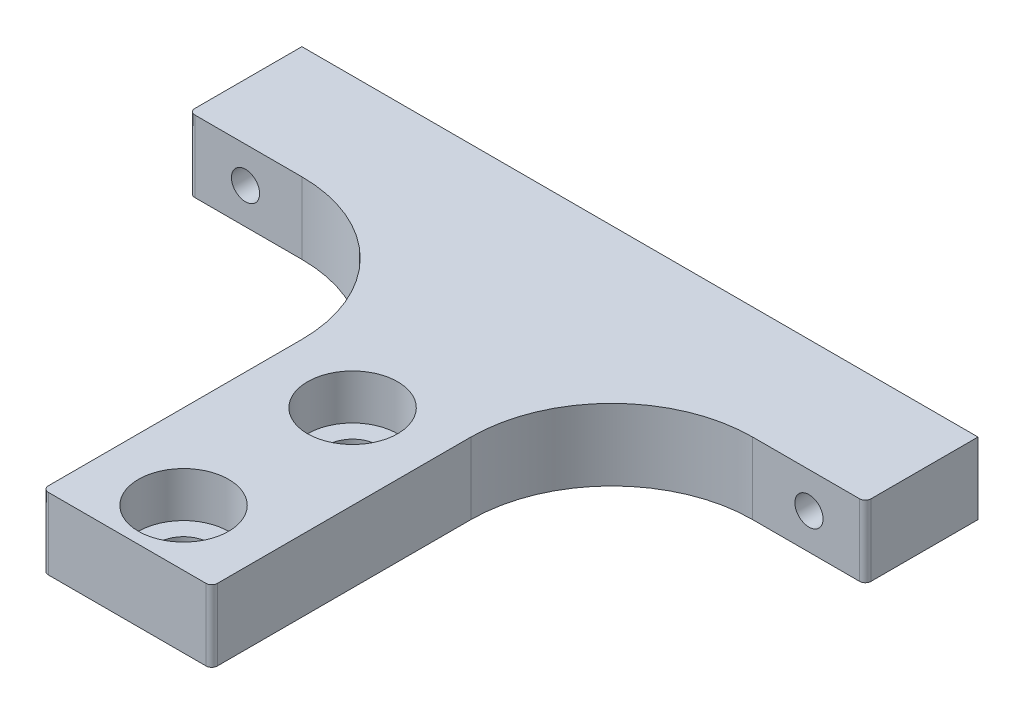
ISO-10303-21;
HEADER;
FILE_DESCRIPTION(('STEP AP214'),'2;1');
FILE_NAME('part.step','',(''),(''),'','','');
FILE_SCHEMA(('AUTOMOTIVE_DESIGN { 1 0 10303 214 1 1 1 1 }'));
ENDSEC;
DATA;
#1=APPLICATION_CONTEXT('core data for automotive mechanical design processes');
#2=APPLICATION_PROTOCOL_DEFINITION('international standard','automotive_design',2000,#1);
#3=PRODUCT_CONTEXT('',#1,'mechanical');
#4=PRODUCT('Part','Part','',(#3));
#5=PRODUCT_RELATED_PRODUCT_CATEGORY('part','',(#4));
#6=PRODUCT_DEFINITION_FORMATION('','',#4);
#7=PRODUCT_DEFINITION_CONTEXT('part definition',#1,'design');
#8=PRODUCT_DEFINITION('design','',#6,#7);
#9=PRODUCT_DEFINITION_SHAPE('','',#8);
#10=(LENGTH_UNIT() NAMED_UNIT(*) SI_UNIT(.MILLI.,.METRE.));
#11=(NAMED_UNIT(*) PLANE_ANGLE_UNIT() SI_UNIT($,.RADIAN.));
#12=(NAMED_UNIT(*) SI_UNIT($,.STERADIAN.) SOLID_ANGLE_UNIT());
#13=UNCERTAINTY_MEASURE_WITH_UNIT(LENGTH_MEASURE(1.E-05),#10,'distance_accuracy_value','');
#14=(GEOMETRIC_REPRESENTATION_CONTEXT(3) GLOBAL_UNCERTAINTY_ASSIGNED_CONTEXT((#13)) GLOBAL_UNIT_ASSIGNED_CONTEXT((#10,
#11,#12)) REPRESENTATION_CONTEXT('',''));
#15=CARTESIAN_POINT('',(0.,0.,0.));
#16=DIRECTION('',(0.,0.,1.));
#17=DIRECTION('',(1.,0.,0.));
#18=AXIS2_PLACEMENT_3D('',#15,#16,#17);
#19=CARTESIAN_POINT('',(0.,6.35,25.5));
#20=DIRECTION('',(0.,1.,0.));
#21=DIRECTION('',(0.,0.,1.));
#22=AXIS2_PLACEMENT_3D('',#19,#20,#21);
#23=CYLINDRICAL_SURFACE('',#22,2.25);
#24=CARTESIAN_POINT('',(0.,0.,25.5));
#25=DIRECTION('',(0.,1.,0.));
#26=DIRECTION('',(0.,0.,1.));
#27=AXIS2_PLACEMENT_3D('',#24,#25,#26);
#28=CIRCLE('',#27,2.25);
#29=CARTESIAN_POINT('',(0.,0.,27.75));
#30=VERTEX_POINT('',#29);
#31=CARTESIAN_POINT('',(0.,0.,23.25));
#32=VERTEX_POINT('',#31);
#33=EDGE_CURVE('E293',#30,#32,#28,.T.);
#34=ORIENTED_EDGE('',*,*,#33,.F.);
#35=DIRECTION('',(0.,1.,0.));
#36=VECTOR('',#35,1.);
#37=CARTESIAN_POINT('',(0.,6.35,27.75));
#38=LINE('',#37,#36);
#39=CARTESIAN_POINT('',(0.,2.35,27.75));
#40=VERTEX_POINT('',#39);
#41=EDGE_CURVE('E13',#30,#40,#38,.T.);
#42=ORIENTED_EDGE('',*,*,#41,.T.);
#43=CARTESIAN_POINT('',(0.,2.35,25.5));
#44=DIRECTION('',(0.,1.,0.));
#45=DIRECTION('',(0.,0.,1.));
#46=AXIS2_PLACEMENT_3D('',#43,#44,#45);
#47=CIRCLE('',#46,2.25);
#48=CARTESIAN_POINT('',(0.,2.35,23.25));
#49=VERTEX_POINT('',#48);
#50=EDGE_CURVE('E295',#40,#49,#47,.T.);
#51=ORIENTED_EDGE('',*,*,#50,.T.);
#52=DIRECTION('',(0.,-1.,0.));
#53=VECTOR('',#52,1.);
#54=CARTESIAN_POINT('',(0.,6.35,23.25));
#55=LINE('',#54,#53);
#56=EDGE_CURVE('E60',#49,#32,#55,.T.);
#57=ORIENTED_EDGE('',*,*,#56,.T.);
#58=EDGE_LOOP('',(#34,#42,#51,#57));
#59=FACE_BOUND('',#58,.T.);
#60=ADVANCED_FACE('F52',(#59),#23,.F.);
#61=CARTESIAN_POINT('',(0.,6.35,40.5));
#62=DIRECTION('',(0.,1.,0.));
#63=DIRECTION('',(0.,0.,1.));
#64=AXIS2_PLACEMENT_3D('',#61,#62,#63);
#65=CYLINDRICAL_SURFACE('',#64,2.25);
#66=CARTESIAN_POINT('',(0.,0.,40.5));
#67=DIRECTION('',(0.,1.,0.));
#68=DIRECTION('',(0.,0.,1.));
#69=AXIS2_PLACEMENT_3D('',#66,#67,#68);
#70=CIRCLE('',#69,2.25);
#71=CARTESIAN_POINT('',(0.,0.,42.75));
#72=VERTEX_POINT('',#71);
#73=CARTESIAN_POINT('',(0.,0.,38.25));
#74=VERTEX_POINT('',#73);
#75=EDGE_CURVE('E315',#72,#74,#70,.T.);
#76=ORIENTED_EDGE('',*,*,#75,.F.);
#77=DIRECTION('',(0.,1.,0.));
#78=VECTOR('',#77,1.);
#79=CARTESIAN_POINT('',(0.,6.35,42.75));
#80=LINE('',#79,#78);
#81=CARTESIAN_POINT('',(0.,2.35,42.75));
#82=VERTEX_POINT('',#81);
#83=EDGE_CURVE('E290',#72,#82,#80,.T.);
#84=ORIENTED_EDGE('',*,*,#83,.T.);
#85=CARTESIAN_POINT('',(0.,2.35,40.5));
#86=DIRECTION('',(0.,1.,0.));
#87=DIRECTION('',(0.,0.,1.));
#88=AXIS2_PLACEMENT_3D('',#85,#86,#87);
#89=CIRCLE('',#88,2.25);
#90=CARTESIAN_POINT('',(0.,2.35,38.25));
#91=VERTEX_POINT('',#90);
#92=EDGE_CURVE('E311',#82,#91,#89,.T.);
#93=ORIENTED_EDGE('',*,*,#92,.T.);
#94=DIRECTION('',(0.,-1.,0.));
#95=VECTOR('',#94,1.);
#96=CARTESIAN_POINT('',(0.,6.35,38.25));
#97=LINE('',#96,#95);
#98=EDGE_CURVE('E287',#91,#74,#97,.T.);
#99=ORIENTED_EDGE('',*,*,#98,.T.);
#100=EDGE_LOOP('',(#76,#84,#93,#99));
#101=FACE_BOUND('',#100,.T.);
#102=ADVANCED_FACE('F387',(#101),#65,.F.);
#103=CARTESIAN_POINT('',(-30.,6.35,0.));
#104=DIRECTION('',(0.,0.,1.));
#105=DIRECTION('',(1.,0.,0.));
#106=AXIS2_PLACEMENT_3D('',#103,#104,#105);
#107=PLANE('',#106);
#108=DIRECTION('',(-1.,0.,0.));
#109=VECTOR('',#108,1.);
#110=CARTESIAN_POINT('',(-30.,0.,0.));
#111=LINE('',#110,#109);
#112=CARTESIAN_POINT('',(30.,0.,0.));
#113=VERTEX_POINT('',#112);
#114=CARTESIAN_POINT('',(-30.,0.,0.));
#115=VERTEX_POINT('',#114);
#116=EDGE_CURVE('E223',#113,#115,#111,.T.);
#117=ORIENTED_EDGE('',*,*,#116,.T.);
#118=DIRECTION('',(0.,-1.,0.));
#119=VECTOR('',#118,1.);
#120=CARTESIAN_POINT('',(-30.,6.35,0.));
#121=LINE('',#120,#119);
#122=CARTESIAN_POINT('',(-30.,6.35,0.));
#123=VERTEX_POINT('',#122);
#124=EDGE_CURVE('E197',#123,#115,#121,.T.);
#125=ORIENTED_EDGE('',*,*,#124,.F.);
#126=DIRECTION('',(-1.,0.,0.));
#127=VECTOR('',#126,1.);
#128=CARTESIAN_POINT('',(-30.,6.35,0.));
#129=LINE('',#128,#127);
#130=CARTESIAN_POINT('',(30.,6.35,0.));
#131=VERTEX_POINT('',#130);
#132=EDGE_CURVE('E179',#131,#123,#129,.T.);
#133=ORIENTED_EDGE('',*,*,#132,.F.);
#134=DIRECTION('',(0.,-1.,0.));
#135=VECTOR('',#134,1.);
#136=CARTESIAN_POINT('',(30.,6.35,0.));
#137=LINE('',#136,#135);
#138=EDGE_CURVE('E190',#131,#113,#137,.T.);
#139=ORIENTED_EDGE('',*,*,#138,.T.);
#140=EDGE_LOOP('',(#117,#125,#133,#139));
#141=FACE_BOUND('',#140,.T.);
#142=CARTESIAN_POINT('',(25.,3.175,0.));
#143=DIRECTION('',(0.,0.,-1.));
#144=DIRECTION('',(-1.,0.,0.));
#145=AXIS2_PLACEMENT_3D('',#142,#143,#144);
#146=CIRCLE('',#145,1.24999999999999);
#147=CARTESIAN_POINT('',(23.75,3.175,0.));
#148=VERTEX_POINT('',#147);
#149=EDGE_CURVE('E623',#148,#148,#146,.T.);
#150=ORIENTED_EDGE('',*,*,#149,.F.);
#151=EDGE_LOOP('',(#150));
#152=FACE_BOUND('',#151,.T.);
#153=CARTESIAN_POINT('',(-25.,3.175,0.));
#154=DIRECTION('',(0.,0.,-1.));
#155=DIRECTION('',(-1.,0.,0.));
#156=AXIS2_PLACEMENT_3D('',#153,#154,#155);
#157=CIRCLE('',#156,1.24999999999999);
#158=CARTESIAN_POINT('',(-26.25,3.175,0.));
#159=VERTEX_POINT('',#158);
#160=EDGE_CURVE('E620',#159,#159,#157,.T.);
#161=ORIENTED_EDGE('',*,*,#160,.F.);
#162=EDGE_LOOP('',(#161));
#163=FACE_BOUND('',#162,.T.);
#164=ADVANCED_FACE('F199',(#141,#152,#163),#107,.F.);
#165=CARTESIAN_POINT('',(-7.5,6.35,10.));
#166=DIRECTION('',(1.,0.,0.));
#167=DIRECTION('',(0.,0.,-1.));
#168=AXIS2_PLACEMENT_3D('',#165,#166,#167);
#169=PLANE('',#168);
#170=DIRECTION('',(0.,0.,1.));
#171=VECTOR('',#170,1.);
#172=CARTESIAN_POINT('',(-7.5,0.,10.));
#173=LINE('',#172,#171);
#174=CARTESIAN_POINT('',(-7.5,0.,22.5));
#175=VERTEX_POINT('',#174);
#176=CARTESIAN_POINT('',(-7.49999999999999,0.,45.));
#177=VERTEX_POINT('',#176);
#178=EDGE_CURVE('E210',#175,#177,#173,.T.);
#179=ORIENTED_EDGE('',*,*,#178,.T.);
#180=DIRECTION('',(0.,-1.,0.));
#181=VECTOR('',#180,1.);
#182=CARTESIAN_POINT('',(-7.49999999999999,6.35,45.));
#183=LINE('',#182,#181);
#184=CARTESIAN_POINT('',(-7.49999999999999,6.35,45.));
#185=VERTEX_POINT('',#184);
#186=EDGE_CURVE('E285',#177,#185,#183,.F.);
#187=ORIENTED_EDGE('',*,*,#186,.T.);
#188=DIRECTION('',(0.,0.,1.));
#189=VECTOR('',#188,1.);
#190=CARTESIAN_POINT('',(-7.5,6.35,10.));
#191=LINE('',#190,#189);
#192=CARTESIAN_POINT('',(-7.5,6.35,22.5));
#193=VERTEX_POINT('',#192);
#194=EDGE_CURVE('E230',#193,#185,#191,.T.);
#195=ORIENTED_EDGE('',*,*,#194,.F.);
#196=DIRECTION('',(0.,-1.,0.));
#197=VECTOR('',#196,1.);
#198=CARTESIAN_POINT('',(-7.5,0.,22.5));
#199=LINE('',#198,#197);
#200=EDGE_CURVE('E237',#193,#175,#199,.T.);
#201=ORIENTED_EDGE('',*,*,#200,.T.);
#202=EDGE_LOOP('',(#179,#187,#195,#201));
#203=FACE_BOUND('',#202,.T.);
#204=ADVANCED_FACE('F355',(#203),#169,.F.);
#205=CARTESIAN_POINT('',(-7.49999999999999,6.35,45.5));
#206=DIRECTION('',(0.,0.,-1.));
#207=DIRECTION('',(-1.,0.,0.));
#208=AXIS2_PLACEMENT_3D('',#205,#206,#207);
#209=PLANE('',#208);
#210=DIRECTION('',(1.,0.,0.));
#211=VECTOR('',#210,1.);
#212=CARTESIAN_POINT('',(-7.49999999999999,0.,45.5));
#213=LINE('',#212,#211);
#214=CARTESIAN_POINT('',(-6.99999999999999,0.,45.5));
#215=VERTEX_POINT('',#214);
#216=CARTESIAN_POINT('',(7.,0.,45.5));
#217=VERTEX_POINT('',#216);
#218=EDGE_CURVE('E213',#215,#217,#213,.T.);
#219=ORIENTED_EDGE('',*,*,#218,.T.);
#220=DIRECTION('',(0.,-1.,0.));
#221=VECTOR('',#220,1.);
#222=CARTESIAN_POINT('',(7.,6.35,45.5));
#223=LINE('',#222,#221);
#224=CARTESIAN_POINT('',(7.,6.35,45.5));
#225=VERTEX_POINT('',#224);
#226=EDGE_CURVE('E279',#217,#225,#223,.F.);
#227=ORIENTED_EDGE('',*,*,#226,.T.);
#228=DIRECTION('',(1.,0.,0.));
#229=VECTOR('',#228,1.);
#230=CARTESIAN_POINT('',(-7.49999999999999,6.35,45.5));
#231=LINE('',#230,#229);
#232=CARTESIAN_POINT('',(-6.99999999999999,6.35,45.5));
#233=VERTEX_POINT('',#232);
#234=EDGE_CURVE('E320',#233,#225,#231,.T.);
#235=ORIENTED_EDGE('',*,*,#234,.F.);
#236=DIRECTION('',(0.,-1.,0.));
#237=VECTOR('',#236,1.);
#238=CARTESIAN_POINT('',(-6.99999999999999,6.35,45.5));
#239=LINE('',#238,#237);
#240=EDGE_CURVE('E276',#233,#215,#239,.T.);
#241=ORIENTED_EDGE('',*,*,#240,.T.);
#242=EDGE_LOOP('',(#219,#227,#235,#241));
#243=FACE_BOUND('',#242,.T.);
#244=ADVANCED_FACE('F362',(#243),#209,.F.);
#245=CARTESIAN_POINT('',(7.5,6.35,10.));
#246=DIRECTION('',(-1.,0.,0.));
#247=DIRECTION('',(0.,0.,1.));
#248=AXIS2_PLACEMENT_3D('',#245,#246,#247);
#249=PLANE('',#248);
#250=DIRECTION('',(0.,0.,-1.));
#251=VECTOR('',#250,1.);
#252=CARTESIAN_POINT('',(7.5,6.35,10.));
#253=LINE('',#252,#251);
#254=CARTESIAN_POINT('',(7.50000000000001,6.35,45.));
#255=VERTEX_POINT('',#254);
#256=CARTESIAN_POINT('',(7.5,6.35,22.5));
#257=VERTEX_POINT('',#256);
#258=EDGE_CURVE('E322',#255,#257,#253,.T.);
#259=ORIENTED_EDGE('',*,*,#258,.F.);
#260=DIRECTION('',(0.,-1.,0.));
#261=VECTOR('',#260,1.);
#262=CARTESIAN_POINT('',(7.50000000000001,6.35,45.));
#263=LINE('',#262,#261);
#264=CARTESIAN_POINT('',(7.50000000000001,0.,45.));
#265=VERTEX_POINT('',#264);
#266=EDGE_CURVE('E269',#255,#265,#263,.T.);
#267=ORIENTED_EDGE('',*,*,#266,.T.);
#268=DIRECTION('',(0.,0.,-1.));
#269=VECTOR('',#268,1.);
#270=CARTESIAN_POINT('',(7.5,0.,10.));
#271=LINE('',#270,#269);
#272=CARTESIAN_POINT('',(7.5,0.,22.5));
#273=VERTEX_POINT('',#272);
#274=EDGE_CURVE('E217',#265,#273,#271,.T.);
#275=ORIENTED_EDGE('',*,*,#274,.T.);
#276=DIRECTION('',(0.,-1.,0.));
#277=VECTOR('',#276,1.);
#278=CARTESIAN_POINT('',(7.5,6.35,22.5));
#279=LINE('',#278,#277);
#280=EDGE_CURVE('E234',#273,#257,#279,.F.);
#281=ORIENTED_EDGE('',*,*,#280,.T.);
#282=EDGE_LOOP('',(#259,#267,#275,#281));
#283=FACE_BOUND('',#282,.T.);
#284=ADVANCED_FACE('F370',(#283),#249,.F.);
#285=CARTESIAN_POINT('',(30.,6.35,9.99999999999999));
#286=DIRECTION('',(0.,0.,-1.));
#287=DIRECTION('',(-1.,0.,0.));
#288=AXIS2_PLACEMENT_3D('',#285,#286,#287);
#289=PLANE('',#288);
#290=CARTESIAN_POINT('',(25.,3.175,9.99999999999999));
#291=DIRECTION('',(0.,0.,-1.));
#292=DIRECTION('',(-1.,0.,0.));
#293=AXIS2_PLACEMENT_3D('',#290,#291,#292);
#294=CIRCLE('',#293,1.25);
#295=CARTESIAN_POINT('',(23.75,3.175,9.99999999999999));
#296=VERTEX_POINT('',#295);
#297=EDGE_CURVE('E628',#296,#296,#294,.T.);
#298=ORIENTED_EDGE('',*,*,#297,.T.);
#299=EDGE_LOOP('',(#298));
#300=FACE_BOUND('',#299,.T.);
#301=DIRECTION('',(1.,0.,0.));
#302=VECTOR('',#301,1.);
#303=CARTESIAN_POINT('',(30.,0.,9.99999999999999));
#304=LINE('',#303,#302);
#305=CARTESIAN_POINT('',(20.,0.,10.));
#306=VERTEX_POINT('',#305);
#307=CARTESIAN_POINT('',(29.5,0.,9.99999999999999));
#308=VERTEX_POINT('',#307);
#309=EDGE_CURVE('E219',#306,#308,#304,.T.);
#310=ORIENTED_EDGE('',*,*,#309,.T.);
#311=DIRECTION('',(0.,-1.,0.));
#312=VECTOR('',#311,1.);
#313=CARTESIAN_POINT('',(29.5,6.35,9.99999999999999));
#314=LINE('',#313,#312);
#315=CARTESIAN_POINT('',(29.5,6.35,9.99999999999999));
#316=VERTEX_POINT('',#315);
#317=EDGE_CURVE('E259',#308,#316,#314,.F.);
#318=ORIENTED_EDGE('',*,*,#317,.T.);
#319=DIRECTION('',(1.,0.,0.));
#320=VECTOR('',#319,1.);
#321=CARTESIAN_POINT('',(30.,6.35,9.99999999999999));
#322=LINE('',#321,#320);
#323=CARTESIAN_POINT('',(20.,6.35,10.));
#324=VERTEX_POINT('',#323);
#325=EDGE_CURVE('E187',#324,#316,#322,.T.);
#326=ORIENTED_EDGE('',*,*,#325,.F.);
#327=DIRECTION('',(0.,-1.,0.));
#328=VECTOR('',#327,1.);
#329=CARTESIAN_POINT('',(20.,0.,10.));
#330=LINE('',#329,#328);
#331=EDGE_CURVE('E196',#324,#306,#330,.T.);
#332=ORIENTED_EDGE('',*,*,#331,.T.);
#333=EDGE_LOOP('',(#310,#318,#326,#332));
#334=FACE_BOUND('',#333,.T.);
#335=ADVANCED_FACE('F374',(#300,#334),#289,.F.);
#336=CARTESIAN_POINT('',(30.,6.35,0.));
#337=DIRECTION('',(-1.,0.,0.));
#338=DIRECTION('',(0.,0.,1.));
#339=AXIS2_PLACEMENT_3D('',#336,#337,#338);
#340=PLANE('',#339);
#341=DIRECTION('',(0.,0.,-1.));
#342=VECTOR('',#341,1.);
#343=CARTESIAN_POINT('',(30.,6.35,0.));
#344=LINE('',#343,#342);
#345=CARTESIAN_POINT('',(30.,6.35,9.49999999999999));
#346=VERTEX_POINT('',#345);
#347=EDGE_CURVE('E173',#346,#131,#344,.T.);
#348=ORIENTED_EDGE('',*,*,#347,.F.);
#349=DIRECTION('',(0.,-1.,0.));
#350=VECTOR('',#349,1.);
#351=CARTESIAN_POINT('',(30.,6.35,9.49999999999999));
#352=LINE('',#351,#350);
#353=CARTESIAN_POINT('',(30.,0.,9.49999999999999));
#354=VERTEX_POINT('',#353);
#355=EDGE_CURVE('E253',#346,#354,#352,.T.);
#356=ORIENTED_EDGE('',*,*,#355,.T.);
#357=DIRECTION('',(0.,0.,-1.));
#358=VECTOR('',#357,1.);
#359=CARTESIAN_POINT('',(30.,0.,0.));
#360=LINE('',#359,#358);
#361=EDGE_CURVE('E193',#354,#113,#360,.T.);
#362=ORIENTED_EDGE('',*,*,#361,.T.);
#363=ORIENTED_EDGE('',*,*,#138,.F.);
#364=EDGE_LOOP('',(#348,#356,#362,#363));
#365=FACE_BOUND('',#364,.T.);
#366=ADVANCED_FACE('F191',(#365),#340,.F.);
#367=CARTESIAN_POINT('',(-30.,6.35,0.));
#368=DIRECTION('',(1.,0.,0.));
#369=DIRECTION('',(0.,0.,-1.));
#370=AXIS2_PLACEMENT_3D('',#367,#368,#369);
#371=PLANE('',#370);
#372=DIRECTION('',(0.,0.,1.));
#373=VECTOR('',#372,1.);
#374=CARTESIAN_POINT('',(-30.,0.,0.));
#375=LINE('',#374,#373);
#376=CARTESIAN_POINT('',(-30.,0.,9.5));
#377=VERTEX_POINT('',#376);
#378=EDGE_CURVE('E225',#115,#377,#375,.T.);
#379=ORIENTED_EDGE('',*,*,#378,.T.);
#380=DIRECTION('',(0.,-1.,0.));
#381=VECTOR('',#380,1.);
#382=CARTESIAN_POINT('',(-30.,6.35,9.5));
#383=LINE('',#382,#381);
#384=CARTESIAN_POINT('',(-30.,6.35,9.5));
#385=VERTEX_POINT('',#384);
#386=EDGE_CURVE('E267',#377,#385,#383,.F.);
#387=ORIENTED_EDGE('',*,*,#386,.T.);
#388=DIRECTION('',(0.,0.,1.));
#389=VECTOR('',#388,1.);
#390=CARTESIAN_POINT('',(-30.,6.35,0.));
#391=LINE('',#390,#389);
#392=EDGE_CURVE('E203',#123,#385,#391,.T.);
#393=ORIENTED_EDGE('',*,*,#392,.F.);
#394=ORIENTED_EDGE('',*,*,#124,.T.);
#395=EDGE_LOOP('',(#379,#387,#393,#394));
#396=FACE_BOUND('',#395,.T.);
#397=ADVANCED_FACE('F336',(#396),#371,.F.);
#398=CARTESIAN_POINT('',(-30.,6.35,10.));
#399=DIRECTION('',(0.,0.,-1.));
#400=DIRECTION('',(-1.,0.,0.));
#401=AXIS2_PLACEMENT_3D('',#398,#399,#400);
#402=PLANE('',#401);
#403=CARTESIAN_POINT('',(-25.,3.175,10.));
#404=DIRECTION('',(0.,0.,-1.));
#405=DIRECTION('',(-1.,0.,0.));
#406=AXIS2_PLACEMENT_3D('',#403,#404,#405);
#407=CIRCLE('',#406,1.25);
#408=CARTESIAN_POINT('',(-26.25,3.175,10.));
#409=VERTEX_POINT('',#408);
#410=EDGE_CURVE('E617',#409,#409,#407,.T.);
#411=ORIENTED_EDGE('',*,*,#410,.T.);
#412=EDGE_LOOP('',(#411));
#413=FACE_BOUND('',#412,.T.);
#414=DIRECTION('',(1.,0.,0.));
#415=VECTOR('',#414,1.);
#416=CARTESIAN_POINT('',(-30.,6.35,10.));
#417=LINE('',#416,#415);
#418=CARTESIAN_POINT('',(-29.5,6.35,10.));
#419=VERTEX_POINT('',#418);
#420=CARTESIAN_POINT('',(-20.,6.35,10.));
#421=VERTEX_POINT('',#420);
#422=EDGE_CURVE('E205',#419,#421,#417,.T.);
#423=ORIENTED_EDGE('',*,*,#422,.F.);
#424=DIRECTION('',(0.,-1.,0.));
#425=VECTOR('',#424,1.);
#426=CARTESIAN_POINT('',(-29.5,6.35,10.));
#427=LINE('',#426,#425);
#428=CARTESIAN_POINT('',(-29.5,0.,10.));
#429=VERTEX_POINT('',#428);
#430=EDGE_CURVE('E264',#419,#429,#427,.T.);
#431=ORIENTED_EDGE('',*,*,#430,.T.);
#432=DIRECTION('',(1.,0.,0.));
#433=VECTOR('',#432,1.);
#434=CARTESIAN_POINT('',(-30.,0.,10.));
#435=LINE('',#434,#433);
#436=CARTESIAN_POINT('',(-20.,0.,10.));
#437=VERTEX_POINT('',#436);
#438=EDGE_CURVE('E228',#429,#437,#435,.T.);
#439=ORIENTED_EDGE('',*,*,#438,.T.);
#440=DIRECTION('',(0.,-1.,0.));
#441=VECTOR('',#440,1.);
#442=CARTESIAN_POINT('',(-20.,6.35,10.));
#443=LINE('',#442,#441);
#444=EDGE_CURVE('E240',#437,#421,#443,.F.);
#445=ORIENTED_EDGE('',*,*,#444,.T.);
#446=EDGE_LOOP('',(#423,#431,#439,#445));
#447=FACE_BOUND('',#446,.T.);
#448=ADVANCED_FACE('F345',(#413,#447),#402,.F.);
#449=CARTESIAN_POINT('',(0.,6.35,0.));
#450=DIRECTION('',(0.,1.,0.));
#451=DIRECTION('',(0.,0.,1.));
#452=AXIS2_PLACEMENT_3D('',#449,#450,#451);
#453=PLANE('',#452);
#454=CARTESIAN_POINT('',(0.,6.35,25.5));
#455=DIRECTION('',(0.,1.,0.));
#456=DIRECTION('',(0.,0.,1.));
#457=AXIS2_PLACEMENT_3D('',#454,#455,#456);
#458=CIRCLE('',#457,4.);
#459=CARTESIAN_POINT('',(0.,6.35,29.5));
#460=VERTEX_POINT('',#459);
#461=EDGE_CURVE('E630',#460,#460,#458,.T.);
#462=ORIENTED_EDGE('',*,*,#461,.F.);
#463=EDGE_LOOP('',(#462));
#464=FACE_BOUND('',#463,.T.);
#465=CARTESIAN_POINT('',(0.,6.35,40.5));
#466=DIRECTION('',(0.,1.,0.));
#467=DIRECTION('',(0.,0.,1.));
#468=AXIS2_PLACEMENT_3D('',#465,#466,#467);
#469=CIRCLE('',#468,4.);
#470=CARTESIAN_POINT('',(0.,6.35,44.5));
#471=VERTEX_POINT('',#470);
#472=EDGE_CURVE('E300',#471,#471,#469,.T.);
#473=ORIENTED_EDGE('',*,*,#472,.F.);
#474=EDGE_LOOP('',(#473));
#475=FACE_BOUND('',#474,.T.);
#476=ORIENTED_EDGE('',*,*,#234,.T.);
#477=CARTESIAN_POINT('',(7.00000000000001,6.35,45.));
#478=DIRECTION('',(0.,1.,0.));
#479=DIRECTION('',(0.,0.,1.));
#480=AXIS2_PLACEMENT_3D('',#477,#478,#479);
#481=CIRCLE('',#480,0.5);
#482=EDGE_CURVE('E283',#225,#255,#481,.T.);
#483=ORIENTED_EDGE('',*,*,#482,.T.);
#484=ORIENTED_EDGE('',*,*,#258,.T.);
#485=CARTESIAN_POINT('',(20.,6.35,22.5));
#486=DIRECTION('',(0.,1.,0.));
#487=DIRECTION('',(0.,0.,1.));
#488=AXIS2_PLACEMENT_3D('',#485,#486,#487);
#489=CIRCLE('',#488,12.5);
#490=EDGE_CURVE('E246',#257,#324,#489,.F.);
#491=ORIENTED_EDGE('',*,*,#490,.T.);
#492=ORIENTED_EDGE('',*,*,#325,.T.);
#493=CARTESIAN_POINT('',(29.5,6.35,9.49999999999999));
#494=DIRECTION('',(0.,1.,0.));
#495=DIRECTION('',(0.,0.,1.));
#496=AXIS2_PLACEMENT_3D('',#493,#494,#495);
#497=CIRCLE('',#496,0.5);
#498=EDGE_CURVE('E183',#316,#346,#497,.T.);
#499=ORIENTED_EDGE('',*,*,#498,.T.);
#500=ORIENTED_EDGE('',*,*,#347,.T.);
#501=ORIENTED_EDGE('',*,*,#132,.T.);
#502=ORIENTED_EDGE('',*,*,#392,.T.);
#503=CARTESIAN_POINT('',(-29.5,6.35,9.5));
#504=DIRECTION('',(0.,1.,0.));
#505=DIRECTION('',(0.,0.,1.));
#506=AXIS2_PLACEMENT_3D('',#503,#504,#505);
#507=CIRCLE('',#506,0.5);
#508=EDGE_CURVE('E261',#385,#419,#507,.T.);
#509=ORIENTED_EDGE('',*,*,#508,.T.);
#510=ORIENTED_EDGE('',*,*,#422,.T.);
#511=CARTESIAN_POINT('',(-20.,6.35,22.5));
#512=DIRECTION('',(0.,1.,0.));
#513=DIRECTION('',(0.,0.,1.));
#514=AXIS2_PLACEMENT_3D('',#511,#512,#513);
#515=CIRCLE('',#514,12.5);
#516=EDGE_CURVE('E251',#421,#193,#515,.F.);
#517=ORIENTED_EDGE('',*,*,#516,.T.);
#518=ORIENTED_EDGE('',*,*,#194,.T.);
#519=CARTESIAN_POINT('',(-6.99999999999999,6.35,45.));
#520=DIRECTION('',(0.,1.,0.));
#521=DIRECTION('',(0.,0.,1.));
#522=AXIS2_PLACEMENT_3D('',#519,#520,#521);
#523=CIRCLE('',#522,0.5);
#524=EDGE_CURVE('E281',#185,#233,#523,.T.);
#525=ORIENTED_EDGE('',*,*,#524,.T.);
#526=EDGE_LOOP('',(#476,#483,#484,#491,#492,#499,#500,#501,#502,#509,#510,#517,#518,#525));
#527=FACE_BOUND('',#526,.T.);
#528=ADVANCED_FACE('F176',(#464,#475,#527),#453,.T.);
#529=CARTESIAN_POINT('',(0.,0.,0.));
#530=DIRECTION('',(0.,1.,0.));
#531=DIRECTION('',(0.,0.,1.));
#532=AXIS2_PLACEMENT_3D('',#529,#530,#531);
#533=PLANE('',#532);
#534=EDGE_CURVE('E297',#32,#30,#28,.T.);
#535=ORIENTED_EDGE('',*,*,#534,.T.);
#536=ORIENTED_EDGE('',*,*,#33,.T.);
#537=EDGE_LOOP('',(#535,#536));
#538=FACE_BOUND('',#537,.T.);
#539=EDGE_CURVE('E214',#74,#72,#70,.T.);
#540=ORIENTED_EDGE('',*,*,#539,.T.);
#541=ORIENTED_EDGE('',*,*,#75,.T.);
#542=EDGE_LOOP('',(#540,#541));
#543=FACE_BOUND('',#542,.T.);
#544=ORIENTED_EDGE('',*,*,#274,.F.);
#545=CARTESIAN_POINT('',(7.00000000000001,0.,45.));
#546=DIRECTION('',(0.,1.,0.));
#547=DIRECTION('',(0.,0.,1.));
#548=AXIS2_PLACEMENT_3D('',#545,#546,#547);
#549=CIRCLE('',#548,0.5);
#550=EDGE_CURVE('E274',#265,#217,#549,.F.);
#551=ORIENTED_EDGE('',*,*,#550,.T.);
#552=ORIENTED_EDGE('',*,*,#218,.F.);
#553=CARTESIAN_POINT('',(-6.99999999999999,0.,45.));
#554=DIRECTION('',(0.,1.,0.));
#555=DIRECTION('',(0.,0.,1.));
#556=AXIS2_PLACEMENT_3D('',#553,#554,#555);
#557=CIRCLE('',#556,0.5);
#558=EDGE_CURVE('E272',#215,#177,#557,.F.);
#559=ORIENTED_EDGE('',*,*,#558,.T.);
#560=ORIENTED_EDGE('',*,*,#178,.F.);
#561=CARTESIAN_POINT('',(-20.,0.,22.5));
#562=DIRECTION('',(0.,1.,0.));
#563=DIRECTION('',(0.,0.,1.));
#564=AXIS2_PLACEMENT_3D('',#561,#562,#563);
#565=CIRCLE('',#564,12.5);
#566=EDGE_CURVE('E248',#175,#437,#565,.T.);
#567=ORIENTED_EDGE('',*,*,#566,.T.);
#568=ORIENTED_EDGE('',*,*,#438,.F.);
#569=CARTESIAN_POINT('',(-29.5,0.,9.5));
#570=DIRECTION('',(0.,1.,0.));
#571=DIRECTION('',(0.,0.,1.));
#572=AXIS2_PLACEMENT_3D('',#569,#570,#571);
#573=CIRCLE('',#572,0.5);
#574=EDGE_CURVE('E255',#429,#377,#573,.F.);
#575=ORIENTED_EDGE('',*,*,#574,.T.);
#576=ORIENTED_EDGE('',*,*,#378,.F.);
#577=ORIENTED_EDGE('',*,*,#116,.F.);
#578=ORIENTED_EDGE('',*,*,#361,.F.);
#579=CARTESIAN_POINT('',(29.5,0.,9.49999999999999));
#580=DIRECTION('',(0.,1.,0.));
#581=DIRECTION('',(0.,0.,1.));
#582=AXIS2_PLACEMENT_3D('',#579,#580,#581);
#583=CIRCLE('',#582,0.5);
#584=EDGE_CURVE('E257',#354,#308,#583,.F.);
#585=ORIENTED_EDGE('',*,*,#584,.T.);
#586=ORIENTED_EDGE('',*,*,#309,.F.);
#587=CARTESIAN_POINT('',(20.,0.,22.5));
#588=DIRECTION('',(0.,1.,0.));
#589=DIRECTION('',(0.,0.,1.));
#590=AXIS2_PLACEMENT_3D('',#587,#588,#589);
#591=CIRCLE('',#590,12.5);
#592=EDGE_CURVE('E243',#306,#273,#591,.T.);
#593=ORIENTED_EDGE('',*,*,#592,.T.);
#594=EDGE_LOOP('',(#544,#551,#552,#559,#560,#567,#568,#575,#576,#577,#578,#585,#586,#593));
#595=FACE_BOUND('',#594,.T.);
#596=ADVANCED_FACE('F332',(#538,#543,#595),#533,.F.);
#597=CARTESIAN_POINT('',(20.,6.35,22.5));
#598=DIRECTION('',(0.,1.,0.));
#599=DIRECTION('',(0.,0.,1.));
#600=AXIS2_PLACEMENT_3D('',#597,#598,#599);
#601=CYLINDRICAL_SURFACE('',#600,12.5);
#602=ORIENTED_EDGE('',*,*,#490,.F.);
#603=ORIENTED_EDGE('',*,*,#280,.F.);
#604=ORIENTED_EDGE('',*,*,#592,.F.);
#605=ORIENTED_EDGE('',*,*,#331,.F.);
#606=EDGE_LOOP('',(#602,#603,#604,#605));
#607=FACE_BOUND('',#606,.T.);
#608=ADVANCED_FACE('F373',(#607),#601,.F.);
#609=CARTESIAN_POINT('',(-20.,6.35,22.5));
#610=DIRECTION('',(0.,1.,0.));
#611=DIRECTION('',(0.,0.,1.));
#612=AXIS2_PLACEMENT_3D('',#609,#610,#611);
#613=CYLINDRICAL_SURFACE('',#612,12.5);
#614=ORIENTED_EDGE('',*,*,#516,.F.);
#615=ORIENTED_EDGE('',*,*,#444,.F.);
#616=ORIENTED_EDGE('',*,*,#566,.F.);
#617=ORIENTED_EDGE('',*,*,#200,.F.);
#618=EDGE_LOOP('',(#614,#615,#616,#617));
#619=FACE_BOUND('',#618,.T.);
#620=ADVANCED_FACE('F351',(#619),#613,.F.);
#621=ORIENTED_EDGE('',*,*,#83,.F.);
#622=ORIENTED_EDGE('',*,*,#539,.F.);
#623=ORIENTED_EDGE('',*,*,#98,.F.);
#624=EDGE_CURVE('E312',#91,#82,#89,.T.);
#625=ORIENTED_EDGE('',*,*,#624,.T.);
#626=EDGE_LOOP('',(#621,#622,#623,#625));
#627=FACE_BOUND('',#626,.T.);
#628=ADVANCED_FACE('F394',(#627),#65,.F.);
#629=CARTESIAN_POINT('',(2.25,2.35,40.5));
#630=DIRECTION('',(0.,-1.,0.));
#631=DIRECTION('',(0.,0.,-1.));
#632=AXIS2_PLACEMENT_3D('',#629,#630,#631);
#633=PLANE('',#632);
#634=ORIENTED_EDGE('',*,*,#624,.F.);
#635=ORIENTED_EDGE('',*,*,#92,.F.);
#636=EDGE_LOOP('',(#634,#635));
#637=FACE_BOUND('',#636,.T.);
#638=CARTESIAN_POINT('',(0.,2.35,40.5));
#639=DIRECTION('',(0.,1.,0.));
#640=DIRECTION('',(0.,0.,1.));
#641=AXIS2_PLACEMENT_3D('',#638,#639,#640);
#642=CIRCLE('',#641,4.);
#643=CARTESIAN_POINT('',(0.,2.35,44.5));
#644=VERTEX_POINT('',#643);
#645=EDGE_CURVE('E303',#644,#644,#642,.T.);
#646=ORIENTED_EDGE('',*,*,#645,.T.);
#647=EDGE_LOOP('',(#646));
#648=FACE_BOUND('',#647,.T.);
#649=ADVANCED_FACE('F405',(#637,#648),#633,.F.);
#650=CARTESIAN_POINT('',(0.,6.35,40.5));
#651=DIRECTION('',(0.,1.,0.));
#652=DIRECTION('',(0.,0.,1.));
#653=AXIS2_PLACEMENT_3D('',#650,#651,#652);
#654=CYLINDRICAL_SURFACE('',#653,4.);
#655=ORIENTED_EDGE('',*,*,#645,.F.);
#656=EDGE_LOOP('',(#655));
#657=FACE_BOUND('',#656,.T.);
#658=ORIENTED_EDGE('',*,*,#472,.T.);
#659=EDGE_LOOP('',(#658));
#660=FACE_BOUND('',#659,.T.);
#661=ADVANCED_FACE('F399',(#657,#660),#654,.F.);
#662=ORIENTED_EDGE('',*,*,#41,.F.);
#663=ORIENTED_EDGE('',*,*,#534,.F.);
#664=ORIENTED_EDGE('',*,*,#56,.F.);
#665=EDGE_CURVE('E305',#49,#40,#47,.T.);
#666=ORIENTED_EDGE('',*,*,#665,.T.);
#667=EDGE_LOOP('',(#662,#663,#664,#666));
#668=FACE_BOUND('',#667,.T.);
#669=ADVANCED_FACE('F298',(#668),#23,.F.);
#670=CARTESIAN_POINT('',(2.25,2.35,25.5));
#671=DIRECTION('',(0.,-1.,0.));
#672=DIRECTION('',(0.,0.,-1.));
#673=AXIS2_PLACEMENT_3D('',#670,#671,#672);
#674=PLANE('',#673);
#675=ORIENTED_EDGE('',*,*,#665,.F.);
#676=ORIENTED_EDGE('',*,*,#50,.F.);
#677=EDGE_LOOP('',(#675,#676));
#678=FACE_BOUND('',#677,.T.);
#679=CARTESIAN_POINT('',(0.,2.35,25.5));
#680=DIRECTION('',(0.,1.,0.));
#681=DIRECTION('',(0.,0.,1.));
#682=AXIS2_PLACEMENT_3D('',#679,#680,#681);
#683=CIRCLE('',#682,4.);
#684=CARTESIAN_POINT('',(0.,2.35,29.5));
#685=VERTEX_POINT('',#684);
#686=EDGE_CURVE('E632',#685,#685,#683,.T.);
#687=ORIENTED_EDGE('',*,*,#686,.T.);
#688=EDGE_LOOP('',(#687));
#689=FACE_BOUND('',#688,.T.);
#690=ADVANCED_FACE('F398',(#678,#689),#674,.F.);
#691=CARTESIAN_POINT('',(0.,6.35,25.5));
#692=DIRECTION('',(0.,1.,0.));
#693=DIRECTION('',(0.,0.,1.));
#694=AXIS2_PLACEMENT_3D('',#691,#692,#693);
#695=CYLINDRICAL_SURFACE('',#694,4.);
#696=ORIENTED_EDGE('',*,*,#686,.F.);
#697=EDGE_LOOP('',(#696));
#698=FACE_BOUND('',#697,.T.);
#699=ORIENTED_EDGE('',*,*,#461,.T.);
#700=EDGE_LOOP('',(#699));
#701=FACE_BOUND('',#700,.T.);
#702=ADVANCED_FACE('F402',(#698,#701),#695,.F.);
#703=CARTESIAN_POINT('',(25.,3.175,0.));
#704=DIRECTION('',(0.,0.,-1.));
#705=DIRECTION('',(-1.,0.,0.));
#706=AXIS2_PLACEMENT_3D('',#703,#704,#705);
#707=CYLINDRICAL_SURFACE('',#706,1.25);
#708=ORIENTED_EDGE('',*,*,#297,.F.);
#709=EDGE_LOOP('',(#708));
#710=FACE_BOUND('',#709,.T.);
#711=ORIENTED_EDGE('',*,*,#149,.T.);
#712=EDGE_LOOP('',(#711));
#713=FACE_BOUND('',#712,.T.);
#714=ADVANCED_FACE('F499',(#710,#713),#707,.F.);
#715=CARTESIAN_POINT('',(-25.,3.175,0.));
#716=DIRECTION('',(0.,0.,-1.));
#717=DIRECTION('',(-1.,0.,0.));
#718=AXIS2_PLACEMENT_3D('',#715,#716,#717);
#719=CYLINDRICAL_SURFACE('',#718,1.25);
#720=ORIENTED_EDGE('',*,*,#410,.F.);
#721=EDGE_LOOP('',(#720));
#722=FACE_BOUND('',#721,.T.);
#723=ORIENTED_EDGE('',*,*,#160,.T.);
#724=EDGE_LOOP('',(#723));
#725=FACE_BOUND('',#724,.T.);
#726=ADVANCED_FACE('F443',(#722,#725),#719,.F.);
#727=CARTESIAN_POINT('',(29.5,6.35,9.49999999999999));
#728=DIRECTION('',(0.,-1.,0.));
#729=DIRECTION('',(0.,0.,-1.));
#730=AXIS2_PLACEMENT_3D('',#727,#728,#729);
#731=CYLINDRICAL_SURFACE('',#730,0.5);
#732=ORIENTED_EDGE('',*,*,#498,.F.);
#733=ORIENTED_EDGE('',*,*,#317,.F.);
#734=ORIENTED_EDGE('',*,*,#584,.F.);
#735=ORIENTED_EDGE('',*,*,#355,.F.);
#736=EDGE_LOOP('',(#732,#733,#734,#735));
#737=FACE_BOUND('',#736,.T.);
#738=ADVANCED_FACE('F329',(#737),#731,.T.);
#739=CARTESIAN_POINT('',(-29.5,6.35,9.5));
#740=DIRECTION('',(0.,-1.,0.));
#741=DIRECTION('',(0.,0.,-1.));
#742=AXIS2_PLACEMENT_3D('',#739,#740,#741);
#743=CYLINDRICAL_SURFACE('',#742,0.5);
#744=ORIENTED_EDGE('',*,*,#508,.F.);
#745=ORIENTED_EDGE('',*,*,#386,.F.);
#746=ORIENTED_EDGE('',*,*,#574,.F.);
#747=ORIENTED_EDGE('',*,*,#430,.F.);
#748=EDGE_LOOP('',(#744,#745,#746,#747));
#749=FACE_BOUND('',#748,.T.);
#750=ADVANCED_FACE('F342',(#749),#743,.T.);
#751=CARTESIAN_POINT('',(7.00000000000001,6.35,45.));
#752=DIRECTION('',(0.,-1.,0.));
#753=DIRECTION('',(0.,0.,-1.));
#754=AXIS2_PLACEMENT_3D('',#751,#752,#753);
#755=CYLINDRICAL_SURFACE('',#754,0.5);
#756=ORIENTED_EDGE('',*,*,#482,.F.);
#757=ORIENTED_EDGE('',*,*,#226,.F.);
#758=ORIENTED_EDGE('',*,*,#550,.F.);
#759=ORIENTED_EDGE('',*,*,#266,.F.);
#760=EDGE_LOOP('',(#756,#757,#758,#759));
#761=FACE_BOUND('',#760,.T.);
#762=ADVANCED_FACE('F366',(#761),#755,.T.);
#763=CARTESIAN_POINT('',(-6.99999999999999,6.35,45.));
#764=DIRECTION('',(0.,-1.,0.));
#765=DIRECTION('',(0.,0.,-1.));
#766=AXIS2_PLACEMENT_3D('',#763,#764,#765);
#767=CYLINDRICAL_SURFACE('',#766,0.5);
#768=ORIENTED_EDGE('',*,*,#524,.F.);
#769=ORIENTED_EDGE('',*,*,#186,.F.);
#770=ORIENTED_EDGE('',*,*,#558,.F.);
#771=ORIENTED_EDGE('',*,*,#240,.F.);
#772=EDGE_LOOP('',(#768,#769,#770,#771));
#773=FACE_BOUND('',#772,.T.);
#774=ADVANCED_FACE('F54',(#773),#767,.T.);
#775=CLOSED_SHELL('',(#60,#102,#164,#204,#244,#284,#335,#366,#397,#448,#528,#596,#608,#620,#628,
#649,#661,#669,#690,#702,#714,#726,#738,#750,#762,#774));
#776=MANIFOLD_SOLID_BREP('B2',#775);
#777=ADVANCED_BREP_SHAPE_REPRESENTATION('',(#18,#776),#14);
#778=SHAPE_DEFINITION_REPRESENTATION(#9,#777);
ENDSEC;
END-ISO-10303-21;
